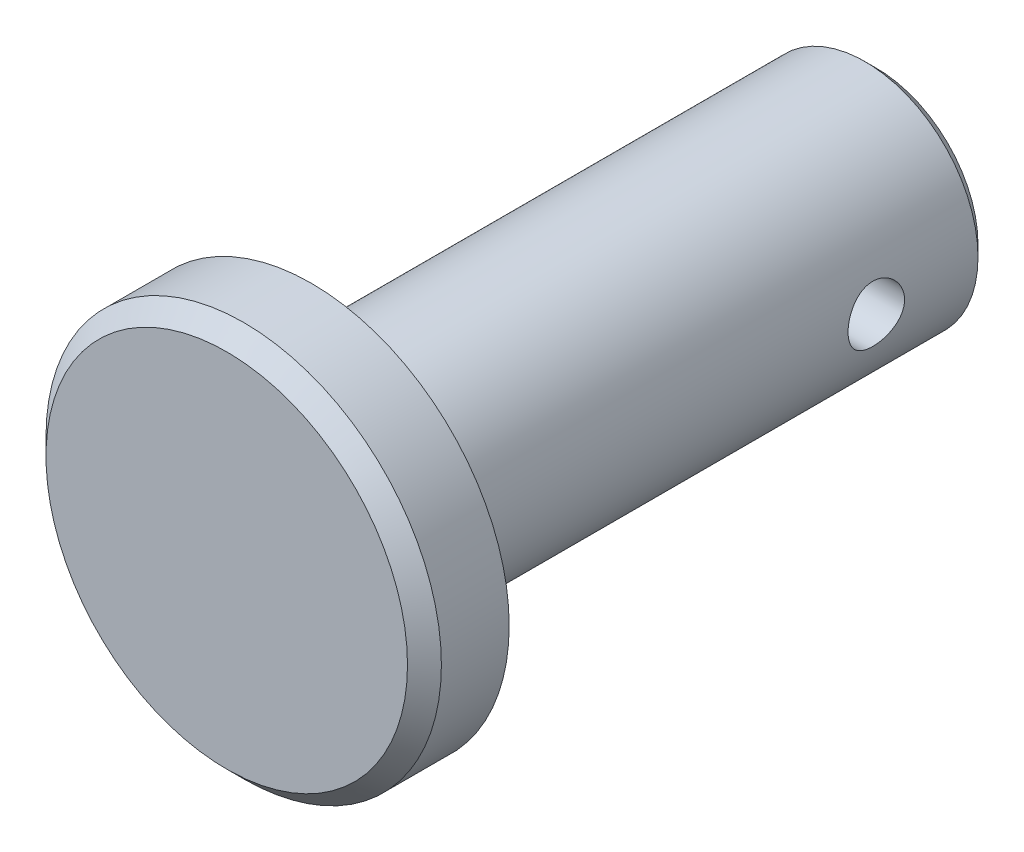
ISO-10303-21;
HEADER;
FILE_DESCRIPTION(('STEP AP214'),'2;1');
FILE_NAME('part.step','',(''),(''),'','','');
FILE_SCHEMA(('AUTOMOTIVE_DESIGN { 1 0 10303 214 1 1 1 1 }'));
ENDSEC;
DATA;
#1=APPLICATION_CONTEXT('core data for automotive mechanical design processes');
#2=APPLICATION_PROTOCOL_DEFINITION('international standard','automotive_design',2000,#1);
#3=PRODUCT_CONTEXT('',#1,'mechanical');
#4=PRODUCT('Part','Part','',(#3));
#5=PRODUCT_RELATED_PRODUCT_CATEGORY('part','',(#4));
#6=PRODUCT_DEFINITION_FORMATION('','',#4);
#7=PRODUCT_DEFINITION_CONTEXT('part definition',#1,'design');
#8=PRODUCT_DEFINITION('design','',#6,#7);
#9=PRODUCT_DEFINITION_SHAPE('','',#8);
#10=(LENGTH_UNIT() NAMED_UNIT(*) SI_UNIT(.MILLI.,.METRE.));
#11=(NAMED_UNIT(*) PLANE_ANGLE_UNIT() SI_UNIT($,.RADIAN.));
#12=(NAMED_UNIT(*) SI_UNIT($,.STERADIAN.) SOLID_ANGLE_UNIT());
#13=UNCERTAINTY_MEASURE_WITH_UNIT(LENGTH_MEASURE(1.E-05),#10,'distance_accuracy_value','');
#14=(GEOMETRIC_REPRESENTATION_CONTEXT(3) GLOBAL_UNCERTAINTY_ASSIGNED_CONTEXT((#13)) GLOBAL_UNIT_ASSIGNED_CONTEXT((#10,
#11,#12)) REPRESENTATION_CONTEXT('',''));
#15=CARTESIAN_POINT('',(0.,0.,0.));
#16=DIRECTION('',(0.,0.,1.));
#17=DIRECTION('',(1.,0.,0.));
#18=AXIS2_PLACEMENT_3D('',#15,#16,#17);
#19=CARTESIAN_POINT('',(0.,0.,10.));
#20=DIRECTION('',(0.,0.,-1.));
#21=DIRECTION('',(-1.,0.,0.));
#22=AXIS2_PLACEMENT_3D('',#19,#20,#21);
#23=CYLINDRICAL_SURFACE('',#22,4.);
#24=CARTESIAN_POINT('',(0.,0.,-9.6));
#25=DIRECTION('',(0.,0.,1.));
#26=DIRECTION('',(1.,0.,0.));
#27=AXIS2_PLACEMENT_3D('',#24,#25,#26);
#28=CIRCLE('',#27,4.);
#29=CARTESIAN_POINT('',(4.,0.,-9.6));
#30=VERTEX_POINT('',#29);
#31=EDGE_CURVE('E40',#30,#30,#28,.T.);
#32=ORIENTED_EDGE('',*,*,#31,.T.);
#33=EDGE_LOOP('',(#32));
#34=FACE_BOUND('',#33,.T.);
#35=CARTESIAN_POINT('',(-4.,0.,-5.));
#36=CARTESIAN_POINT('',(-3.99999906578675,-0.0552507257798209,-5.00000155049211));
#37=CARTESIAN_POINT('',(-3.99884385421219,-0.110518771887176,-5.00459436718253));
#38=CARTESIAN_POINT('',(-3.99434742553261,-0.219470882513689,-5.022816767538));
#39=CARTESIAN_POINT('',(-3.99100496946646,-0.273154031247159,-5.03645147302523));
#40=CARTESIAN_POINT('',(-3.98250417554693,-0.377347248121717,-5.07229283564139));
#41=CARTESIAN_POINT('',(-3.97734801894725,-0.427861042286668,-5.09448919914352));
#42=CARTESIAN_POINT('',(-3.96576895871729,-0.524448087936284,-5.14678759336322));
#43=CARTESIAN_POINT('',(-3.95934601236034,-0.570521189565839,-5.17688989074596));
#44=CARTESIAN_POINT('',(-3.94578275727868,-0.657867951533946,-5.24480052643614));
#45=CARTESIAN_POINT('',(-3.93863138099022,-0.699037126707381,-5.28274104997278));
#46=CARTESIAN_POINT('',(-3.92449080078353,-0.774499284802203,-5.36496813660594));
#47=CARTESIAN_POINT('',(-3.91750161525566,-0.808791491299423,-5.40925541529766));
#48=CARTESIAN_POINT('',(-3.9043651713314,-0.870017695199355,-5.50373015115829));
#49=CARTESIAN_POINT('',(-3.89823196313737,-0.896834810616904,-5.55399548720694));
#50=CARTESIAN_POINT('',(-3.88766329874815,-0.941597939033684,-5.65849894110557));
#51=CARTESIAN_POINT('',(-3.88322757115193,-0.959545370292888,-5.71273642221717));
#52=CARTESIAN_POINT('',(-3.87666984478367,-0.985703224536193,-5.82249566546831));
#53=CARTESIAN_POINT('',(-3.87450327383617,-0.994101512222225,-5.87796993069987));
#54=CARTESIAN_POINT('',(-3.87259575025161,-1.00150785004523,-5.98957904600932));
#55=CARTESIAN_POINT('',(-3.87285440299096,-1.00051742787865,-6.04571378713241));
#56=CARTESIAN_POINT('',(-3.87572803664412,-0.98932434975952,-6.15561053849632));
#57=CARTESIAN_POINT('',(-3.87828575334586,-0.979345560127013,-6.20939708097673));
#58=CARTESIAN_POINT('',(-3.88537806450989,-0.950816124602071,-6.31450736727419));
#59=CARTESIAN_POINT('',(-3.88991279980464,-0.932264868046282,-6.36583093535265));
#60=CARTESIAN_POINT('',(-3.90050075936124,-0.886926318624769,-6.46515867750138));
#61=CARTESIAN_POINT('',(-3.90656884979614,-0.860057778155274,-6.51312411452637));
#62=CARTESIAN_POINT('',(-3.91953140564257,-0.798904184009969,-6.60394580650456));
#63=CARTESIAN_POINT('',(-3.9264260155649,-0.764617832539226,-6.64680116537817));
#64=CARTESIAN_POINT('',(-3.94050587026521,-0.688442283120812,-6.7274690771296));
#65=CARTESIAN_POINT('',(-3.94769379651981,-0.646364172110573,-6.76510299337423));
#66=CARTESIAN_POINT('',(-3.96137310385857,-0.556407945002467,-6.8328141616426));
#67=CARTESIAN_POINT('',(-3.96786446366277,-0.508529651805296,-6.86289118284238));
#68=CARTESIAN_POINT('',(-3.97945154729455,-0.408077259120928,-6.91470039081626));
#69=CARTESIAN_POINT('',(-3.9845424008515,-0.355487595472416,-6.93640356016962));
#70=CARTESIAN_POINT('',(-3.99271944660946,-0.247250672095255,-6.97061153713971));
#71=CARTESIAN_POINT('',(-3.99580602226187,-0.191603999433656,-6.98311810427876));
#72=CARTESIAN_POINT('',(-3.9995699951425,-0.0803599802600179,-6.99830504370589));
#73=CARTESIAN_POINT('',(-4.00030702338852,-0.0247978133254733,-7.0012286840502));
#74=CARTESIAN_POINT('',(-3.999458698763,0.0860219165343385,-6.99783399862967));
#75=CARTESIAN_POINT('',(-3.99787355494564,0.14127950642973,-6.99151650480058));
#76=CARTESIAN_POINT('',(-3.99259720751571,0.249076179184328,-6.97001939440575));
#77=CARTESIAN_POINT('',(-3.98893756123874,0.301643412645836,-6.95497249101534));
#78=CARTESIAN_POINT('',(-3.97992471089423,0.403504861635007,-6.91659527731437));
#79=CARTESIAN_POINT('',(-3.97457133579928,0.452798746021756,-6.89326413045789));
#80=CARTESIAN_POINT('',(-3.96262205284207,0.547682089619898,-6.83850924741685));
#81=CARTESIAN_POINT('',(-3.95600578244621,0.59319029455722,-6.80694925840216));
#82=CARTESIAN_POINT('',(-3.94229672791613,0.678351075762164,-6.73680672746869));
#83=CARTESIAN_POINT('',(-3.93520386167803,0.718002639315338,-6.69822297358873));
#84=CARTESIAN_POINT('',(-3.92112637973847,0.79132704538182,-6.61399869277036));
#85=CARTESIAN_POINT('',(-3.91414869458187,0.824829245081355,-6.56820819799838));
#86=CARTESIAN_POINT('',(-3.90128585584826,0.883673839341798,-6.47151157702285));
#87=CARTESIAN_POINT('',(-3.89540065378017,0.909016596105291,-6.42060567802683));
#88=CARTESIAN_POINT('',(-3.88545396489777,0.950634280406194,-6.31539618505795));
#89=CARTESIAN_POINT('',(-3.88138170194604,0.966962931102709,-6.26111491443733));
#90=CARTESIAN_POINT('',(-3.87551162726789,0.990230439969185,-6.15046024140726));
#91=CARTESIAN_POINT('',(-3.87371331813291,0.997171351652438,-6.09408729931167));
#92=CARTESIAN_POINT('',(-3.87263267469304,1.00135906022266,-5.98258598409653));
#93=CARTESIAN_POINT('',(-3.87327955152176,0.998878598520078,-5.92746837658351));
#94=CARTESIAN_POINT('',(-3.87685272671895,0.984918185541911,-5.81846407422135));
#95=CARTESIAN_POINT('',(-3.87977897927904,0.973438415124513,-5.76457735465757));
#96=CARTESIAN_POINT('',(-3.88754173788482,0.941954212961863,-5.65986102728973));
#97=CARTESIAN_POINT('',(-3.89236676824206,0.922000936453583,-5.60901512983986));
#98=CARTESIAN_POINT('',(-3.90338503816552,0.874176609070047,-5.51135641152421));
#99=CARTESIAN_POINT('',(-3.90957846747182,0.846304460022792,-5.46454415120872));
#100=CARTESIAN_POINT('',(-3.92283756175675,0.782578499091424,-5.37496358066532));
#101=CARTESIAN_POINT('',(-3.92992176554505,0.746535441941503,-5.33233261771736));
#102=CARTESIAN_POINT('',(-3.94405351497524,0.667859580793157,-5.25363530346973));
#103=CARTESIAN_POINT('',(-3.95110105151373,0.625225214174097,-5.21757051325802));
#104=CARTESIAN_POINT('',(-3.96451770431775,0.533645057801727,-5.15239246095693));
#105=CARTESIAN_POINT('',(-3.97087222243912,0.484598948210925,-5.12341692421895));
#106=CARTESIAN_POINT('',(-3.98203283316746,0.382177373006985,-5.07416835803965));
#107=CARTESIAN_POINT('',(-3.98684003466521,0.32880504229116,-5.05388909290098));
#108=CARTESIAN_POINT('',(-3.99365373043694,0.229606835495648,-5.02561877978023));
#109=CARTESIAN_POINT('',(-3.9960172336846,0.184253447272046,-5.01603250463104));
#110=CARTESIAN_POINT('',(-3.99919070154632,0.0926040476908559,-5.00322270425204));
#111=CARTESIAN_POINT('',(-4.00000078300596,0.0463081074950777,-4.99999870046314));
#112=CARTESIAN_POINT('',(-4.,0.,-5.));
#113=B_SPLINE_CURVE_WITH_KNOTS('',3,(#35,#36,#37,#38,#39,#40,#41,#42,#43,#44,#45,#46,#47,#48,
#49,#50,#51,#52,#53,#54,#55,#56,#57,#58,#59,#60,#61,#62,#63,#64,#65,#66,#67,#68,#69,#70,#71,#72,
#73,#74,#75,#76,#77,#78,#79,#80,#81,#82,#83,#84,#85,#86,#87,#88,#89,#90,#91,#92,#93,#94,#95,#96,
#97,#98,#99,#100,#101,#102,#103,#104,#105,#106,#107,#108,#109,#110,#111,#112),.UNSPECIFIED.,.T.,
.F.,(4,2,2,2,2,2,2,2,2,2,2,2,2,2,2,2,2,2,2,2,2,2,2,2,2,2,2,2,2,2,2,2,2,2,2,2,2,2,4),(0.,
0.16558247498126,0.331258825175933,0.496736601524069,0.662219960112885,0.83076290291426,
0.999324863867079,1.17039098363871,1.34142974112912,1.50904196732953,1.67662692075131,
1.84014998004678,2.00368468977359,2.16887018582586,2.33408460557442,2.50401000646013,
2.67394059705498,2.84445486006076,3.01493649125762,3.18105539299517,3.34715934075162,
3.51080183009358,3.67446084881527,3.84102391710234,4.00761575338679,4.17829672802984,
4.34897012499672,4.51861503076024,4.68822282168271,4.85295853599075,5.01769093970689,
5.18144267039631,5.34521712091267,5.51326384273273,5.68135046513611,5.85248123666391,
6.02348909214233,6.16228161961432,6.30106370695359),.UNSPECIFIED.);
#114=CARTESIAN_POINT('',(-4.,0.,-5.));
#115=VERTEX_POINT('',#114);
#116=EDGE_CURVE('E51',#115,#115,#113,.T.);
#117=ORIENTED_EDGE('',*,*,#116,.T.);
#118=EDGE_LOOP('',(#117));
#119=FACE_BOUND('',#118,.T.);
#120=CARTESIAN_POINT('',(4.,0.,-7.));
#121=CARTESIAN_POINT('',(3.99999906578675,-0.0552507257798207,-6.99999844950789));
#122=CARTESIAN_POINT('',(3.99884385421219,-0.110518771887175,-6.99540563281747));
#123=CARTESIAN_POINT('',(3.99434742553261,-0.219470882513688,-6.977183232462));
#124=CARTESIAN_POINT('',(3.99100496946646,-0.273154031247159,-6.96354852697477));
#125=CARTESIAN_POINT('',(3.98250417554693,-0.377347248121718,-6.92770716435861));
#126=CARTESIAN_POINT('',(3.97734801894725,-0.427861042286669,-6.90551080085648));
#127=CARTESIAN_POINT('',(3.96576895871729,-0.524448087936284,-6.85321240663678));
#128=CARTESIAN_POINT('',(3.95934601236034,-0.57052118956584,-6.82311010925404));
#129=CARTESIAN_POINT('',(3.94578275727868,-0.657867951533947,-6.75519947356386));
#130=CARTESIAN_POINT('',(3.93863138099022,-0.699037126707381,-6.71725895002721));
#131=CARTESIAN_POINT('',(3.92449080078353,-0.774499284802203,-6.63503186339405));
#132=CARTESIAN_POINT('',(3.91750161525566,-0.808791491299423,-6.59074458470233));
#133=CARTESIAN_POINT('',(3.9043651713314,-0.870017695199355,-6.49626984884171));
#134=CARTESIAN_POINT('',(3.89823196313737,-0.896834810616904,-6.44600451279306));
#135=CARTESIAN_POINT('',(3.88766329874815,-0.941597939033684,-6.34150105889443));
#136=CARTESIAN_POINT('',(3.88322757115193,-0.959545370292888,-6.28726357778282));
#137=CARTESIAN_POINT('',(3.87666984478367,-0.985703224536193,-6.17750433453168));
#138=CARTESIAN_POINT('',(3.87450327383617,-0.994101512222225,-6.12203006930013));
#139=CARTESIAN_POINT('',(3.87259575025161,-1.00150785004523,-6.01042095399068));
#140=CARTESIAN_POINT('',(3.87285440299096,-1.00051742787865,-5.95428621286759));
#141=CARTESIAN_POINT('',(3.87572803664412,-0.98932434975952,-5.84438946150368));
#142=CARTESIAN_POINT('',(3.87828575334586,-0.979345560127013,-5.79060291902327));
#143=CARTESIAN_POINT('',(3.88537806450989,-0.950816124602071,-5.6854926327258));
#144=CARTESIAN_POINT('',(3.88991279980464,-0.932264868046282,-5.63416906464734));
#145=CARTESIAN_POINT('',(3.90050075936124,-0.886926318624769,-5.53484132249862));
#146=CARTESIAN_POINT('',(3.90656884979614,-0.860057778155273,-5.48687588547363));
#147=CARTESIAN_POINT('',(3.91953140564257,-0.798904184009969,-5.39605419349544));
#148=CARTESIAN_POINT('',(3.9264260155649,-0.764617832539226,-5.35319883462183));
#149=CARTESIAN_POINT('',(3.94050587026521,-0.688442283120812,-5.2725309228704));
#150=CARTESIAN_POINT('',(3.94769379651981,-0.646364172110573,-5.23489700662577));
#151=CARTESIAN_POINT('',(3.96137310385857,-0.556407945002467,-5.1671858383574));
#152=CARTESIAN_POINT('',(3.96786446366277,-0.508529651805296,-5.13710881715762));
#153=CARTESIAN_POINT('',(3.97945154729455,-0.408077259120928,-5.08529960918374));
#154=CARTESIAN_POINT('',(3.9845424008515,-0.355487595472416,-5.06359643983038));
#155=CARTESIAN_POINT('',(3.99271944660946,-0.247250672095255,-5.02938846286028));
#156=CARTESIAN_POINT('',(3.99580602226187,-0.191603999433656,-5.01688189572124));
#157=CARTESIAN_POINT('',(3.9995699951425,-0.0803599802600176,-5.00169495629411));
#158=CARTESIAN_POINT('',(4.00030702338852,-0.0247978133254729,-4.9987713159498));
#159=CARTESIAN_POINT('',(3.999458698763,0.0860219165343389,-5.00216600137032));
#160=CARTESIAN_POINT('',(3.99787355494564,0.14127950642973,-5.00848349519942));
#161=CARTESIAN_POINT('',(3.99259720751571,0.249076179184328,-5.02998060559425));
#162=CARTESIAN_POINT('',(3.98893756123874,0.301643412645837,-5.04502750898466));
#163=CARTESIAN_POINT('',(3.97992471089423,0.403504861635008,-5.08340472268563));
#164=CARTESIAN_POINT('',(3.97457133579928,0.452798746021756,-5.10673586954211));
#165=CARTESIAN_POINT('',(3.96262205284207,0.547682089619898,-5.16149075258315));
#166=CARTESIAN_POINT('',(3.95600578244621,0.59319029455722,-5.19305074159784));
#167=CARTESIAN_POINT('',(3.94229672791613,0.678351075762164,-5.26319327253131));
#168=CARTESIAN_POINT('',(3.93520386167803,0.718002639315339,-5.30177702641127));
#169=CARTESIAN_POINT('',(3.92112637973847,0.791327045381821,-5.38600130722964));
#170=CARTESIAN_POINT('',(3.91414869458187,0.824829245081355,-5.43179180200161));
#171=CARTESIAN_POINT('',(3.90128585584826,0.883673839341799,-5.52848842297714));
#172=CARTESIAN_POINT('',(3.89540065378017,0.909016596105291,-5.57939432197317));
#173=CARTESIAN_POINT('',(3.88545396489777,0.950634280406194,-5.68460381494205));
#174=CARTESIAN_POINT('',(3.88138170194604,0.96696293110271,-5.73888508556267));
#175=CARTESIAN_POINT('',(3.87551162726789,0.990230439969186,-5.84953975859274));
#176=CARTESIAN_POINT('',(3.87371331813291,0.997171351652438,-5.90591270068833));
#177=CARTESIAN_POINT('',(3.87263267469305,1.00135906022266,-6.01741401590347));
#178=CARTESIAN_POINT('',(3.87327955152176,0.998878598520078,-6.07253162341649));
#179=CARTESIAN_POINT('',(3.87685272671895,0.984918185541911,-6.18153592577865));
#180=CARTESIAN_POINT('',(3.87977897927904,0.973438415124513,-6.23542264534243));
#181=CARTESIAN_POINT('',(3.88754173788482,0.941954212961862,-6.34013897271027));
#182=CARTESIAN_POINT('',(3.89236676824206,0.922000936453583,-6.39098487016014));
#183=CARTESIAN_POINT('',(3.90338503816552,0.874176609070046,-6.48864358847579));
#184=CARTESIAN_POINT('',(3.90957846747182,0.846304460022792,-6.53545584879128));
#185=CARTESIAN_POINT('',(3.92283756175675,0.782578499091423,-6.62503641933468));
#186=CARTESIAN_POINT('',(3.92992176554505,0.746535441941502,-6.66766738228264));
#187=CARTESIAN_POINT('',(3.94405351497524,0.667859580793156,-6.74636469653027));
#188=CARTESIAN_POINT('',(3.95110105151373,0.625225214174097,-6.78242948674198));
#189=CARTESIAN_POINT('',(3.96451770431775,0.533645057801727,-6.84760753904307));
#190=CARTESIAN_POINT('',(3.97087222243912,0.484598948210924,-6.87658307578105));
#191=CARTESIAN_POINT('',(3.98203283316746,0.382177373006984,-6.92583164196035));
#192=CARTESIAN_POINT('',(3.98684003466521,0.32880504229116,-6.94611090709902));
#193=CARTESIAN_POINT('',(3.99365373043694,0.229606835495648,-6.97438122021977));
#194=CARTESIAN_POINT('',(3.9960172336846,0.184253447272045,-6.98396749536895));
#195=CARTESIAN_POINT('',(3.99919070154632,0.0926040476908552,-6.99677729574796));
#196=CARTESIAN_POINT('',(4.00000078300596,0.0463081074950774,-7.00000129953687));
#197=CARTESIAN_POINT('',(4.,0.,-7.));
#198=B_SPLINE_CURVE_WITH_KNOTS('',3,(#120,#121,#122,#123,#124,#125,#126,#127,#128,#129,#130,
#131,#132,#133,#134,#135,#136,#137,#138,#139,#140,#141,#142,#143,#144,#145,#146,#147,#148,#149,
#150,#151,#152,#153,#154,#155,#156,#157,#158,#159,#160,#161,#162,#163,#164,#165,#166,#167,#168,
#169,#170,#171,#172,#173,#174,#175,#176,#177,#178,#179,#180,#181,#182,#183,#184,#185,#186,#187,
#188,#189,#190,#191,#192,#193,#194,#195,#196,#197),.UNSPECIFIED.,.T.,.F.,(4,2,2,2,2,2,2,2,2,2,2,
2,2,2,2,2,2,2,2,2,2,2,2,2,2,2,2,2,2,2,2,2,2,2,2,2,2,2,4),(0.,0.16558247498126,0.331258825175933,
0.496736601524071,0.662219960112885,0.83076290291426,0.999324863867079,1.17039098363871,
1.34142974112912,1.50904196732954,1.67662692075131,1.84014998004679,2.00368468977359,
2.16887018582586,2.33408460557442,2.50401000646013,2.67394059705498,2.84445486006076,
3.01493649125762,3.18105539299517,3.34715934075162,3.51080183009358,3.67446084881527,
3.84102391710235,4.00761575338679,4.17829672802984,4.34897012499672,4.51861503076024,
4.68822282168272,4.85295853599075,5.01769093970689,5.18144267039631,5.34521712091267,
5.51326384273273,5.68135046513611,5.85248123666392,6.02348909214233,6.16228161961432,
6.30106370695359),.UNSPECIFIED.);
#199=CARTESIAN_POINT('',(4.,0.,-7.));
#200=VERTEX_POINT('',#199);
#201=EDGE_CURVE('E60',#200,#200,#198,.T.);
#202=ORIENTED_EDGE('',*,*,#201,.T.);
#203=EDGE_LOOP('',(#202));
#204=FACE_BOUND('',#203,.T.);
#205=CARTESIAN_POINT('',(0.,0.,10.));
#206=DIRECTION('',(0.,0.,1.));
#207=DIRECTION('',(1.,0.,0.));
#208=AXIS2_PLACEMENT_3D('',#205,#206,#207);
#209=CIRCLE('',#208,4.);
#210=CARTESIAN_POINT('',(4.,0.,10.));
#211=VERTEX_POINT('',#210);
#212=EDGE_CURVE('E99',#211,#211,#209,.T.);
#213=ORIENTED_EDGE('',*,*,#212,.F.);
#214=EDGE_LOOP('',(#213));
#215=FACE_BOUND('',#214,.T.);
#216=ADVANCED_FACE('F33',(#34,#119,#204,#215),#23,.T.);
#217=CARTESIAN_POINT('',(0.,0.,-10.));
#218=DIRECTION('',(0.,0.,1.));
#219=DIRECTION('',(1.,0.,0.));
#220=AXIS2_PLACEMENT_3D('',#217,#218,#219);
#221=PLANE('',#220);
#222=CARTESIAN_POINT('',(0.,0.,-10.));
#223=DIRECTION('',(0.,0.,1.));
#224=DIRECTION('',(1.,0.,0.));
#225=AXIS2_PLACEMENT_3D('',#222,#223,#224);
#226=CIRCLE('',#225,3.6);
#227=CARTESIAN_POINT('',(3.6,0.,-10.));
#228=VERTEX_POINT('',#227);
#229=EDGE_CURVE('E10',#228,#228,#226,.F.);
#230=ORIENTED_EDGE('',*,*,#229,.T.);
#231=EDGE_LOOP('',(#230));
#232=FACE_BOUND('',#231,.T.);
#233=ADVANCED_FACE('F81',(#232),#221,.F.);
#234=CARTESIAN_POINT('',(0.,0.,10.));
#235=DIRECTION('',(0.,0.,1.));
#236=DIRECTION('',(1.,0.,0.));
#237=AXIS2_PLACEMENT_3D('',#234,#235,#236);
#238=PLANE('',#237);
#239=CARTESIAN_POINT('',(0.,0.,10.));
#240=DIRECTION('',(0.,0.,1.));
#241=DIRECTION('',(1.,0.,0.));
#242=AXIS2_PLACEMENT_3D('',#239,#240,#241);
#243=CIRCLE('',#242,7.);
#244=CARTESIAN_POINT('',(7.,0.,10.));
#245=VERTEX_POINT('',#244);
#246=EDGE_CURVE('E59',#245,#245,#243,.T.);
#247=ORIENTED_EDGE('',*,*,#246,.F.);
#248=EDGE_LOOP('',(#247));
#249=FACE_BOUND('',#248,.T.);
#250=ORIENTED_EDGE('',*,*,#212,.T.);
#251=EDGE_LOOP('',(#250));
#252=FACE_BOUND('',#251,.T.);
#253=ADVANCED_FACE('F78',(#249,#252),#238,.F.);
#254=CARTESIAN_POINT('',(0.,0.,13.));
#255=DIRECTION('',(0.,0.,-1.));
#256=DIRECTION('',(-1.,0.,0.));
#257=AXIS2_PLACEMENT_3D('',#254,#255,#256);
#258=CYLINDRICAL_SURFACE('',#257,7.);
#259=CARTESIAN_POINT('',(0.,0.,12.4));
#260=DIRECTION('',(0.,0.,1.));
#261=DIRECTION('',(1.,0.,0.));
#262=AXIS2_PLACEMENT_3D('',#259,#260,#261);
#263=CIRCLE('',#262,7.);
#264=CARTESIAN_POINT('',(7.,0.,12.4));
#265=VERTEX_POINT('',#264);
#266=EDGE_CURVE('E44',#265,#265,#263,.F.);
#267=ORIENTED_EDGE('',*,*,#266,.T.);
#268=EDGE_LOOP('',(#267));
#269=FACE_BOUND('',#268,.T.);
#270=ORIENTED_EDGE('',*,*,#246,.T.);
#271=EDGE_LOOP('',(#270));
#272=FACE_BOUND('',#271,.T.);
#273=ADVANCED_FACE('F76',(#269,#272),#258,.T.);
#274=CARTESIAN_POINT('',(0.,0.,13.));
#275=DIRECTION('',(0.,0.,1.));
#276=DIRECTION('',(1.,0.,0.));
#277=AXIS2_PLACEMENT_3D('',#274,#275,#276);
#278=PLANE('',#277);
#279=CARTESIAN_POINT('',(0.,0.,13.));
#280=DIRECTION('',(0.,0.,1.));
#281=DIRECTION('',(1.,0.,0.));
#282=AXIS2_PLACEMENT_3D('',#279,#280,#281);
#283=CIRCLE('',#282,6.4);
#284=CARTESIAN_POINT('',(6.4,0.,13.));
#285=VERTEX_POINT('',#284);
#286=EDGE_CURVE('E48',#285,#285,#283,.T.);
#287=ORIENTED_EDGE('',*,*,#286,.T.);
#288=EDGE_LOOP('',(#287));
#289=FACE_BOUND('',#288,.T.);
#290=ADVANCED_FACE('F72',(#289),#278,.T.);
#291=CARTESIAN_POINT('',(0.,0.,13.));
#292=DIRECTION('',(0.,0.,-1.));
#293=DIRECTION('',(-1.,0.,0.));
#294=AXIS2_PLACEMENT_3D('',#291,#292,#293);
#295=CONICAL_SURFACE('',#294,6.4,0.785398163397446);
#296=ORIENTED_EDGE('',*,*,#266,.F.);
#297=EDGE_LOOP('',(#296));
#298=FACE_BOUND('',#297,.T.);
#299=ORIENTED_EDGE('',*,*,#286,.F.);
#300=EDGE_LOOP('',(#299));
#301=FACE_BOUND('',#300,.T.);
#302=ADVANCED_FACE('F70',(#298,#301),#295,.T.);
#303=CARTESIAN_POINT('',(-7.,0.,-6.));
#304=DIRECTION('',(1.,0.,0.));
#305=DIRECTION('',(0.,0.,-1.));
#306=AXIS2_PLACEMENT_3D('',#303,#304,#305);
#307=CYLINDRICAL_SURFACE('',#306,1.);
#308=ORIENTED_EDGE('',*,*,#201,.F.);
#309=EDGE_LOOP('',(#308));
#310=FACE_BOUND('',#309,.T.);
#311=ORIENTED_EDGE('',*,*,#116,.F.);
#312=EDGE_LOOP('',(#311));
#313=FACE_BOUND('',#312,.T.);
#314=ADVANCED_FACE('F66',(#310,#313),#307,.F.);
#315=CARTESIAN_POINT('',(0.,0.,-9.6));
#316=DIRECTION('',(0.,0.,1.));
#317=DIRECTION('',(1.,0.,0.));
#318=AXIS2_PLACEMENT_3D('',#315,#316,#317);
#319=CONICAL_SURFACE('',#318,4.,0.785398163397453);
#320=ORIENTED_EDGE('',*,*,#229,.F.);
#321=EDGE_LOOP('',(#320));
#322=FACE_BOUND('',#321,.T.);
#323=ORIENTED_EDGE('',*,*,#31,.F.);
#324=EDGE_LOOP('',(#323));
#325=FACE_BOUND('',#324,.T.);
#326=ADVANCED_FACE('F35',(#322,#325),#319,.T.);
#327=CLOSED_SHELL('',(#216,#233,#253,#273,#290,#302,#314,#326));
#328=MANIFOLD_SOLID_BREP('B2',#327);
#329=ADVANCED_BREP_SHAPE_REPRESENTATION('',(#18,#328),#14);
#330=SHAPE_DEFINITION_REPRESENTATION(#9,#329);
ENDSEC;
END-ISO-10303-21;
